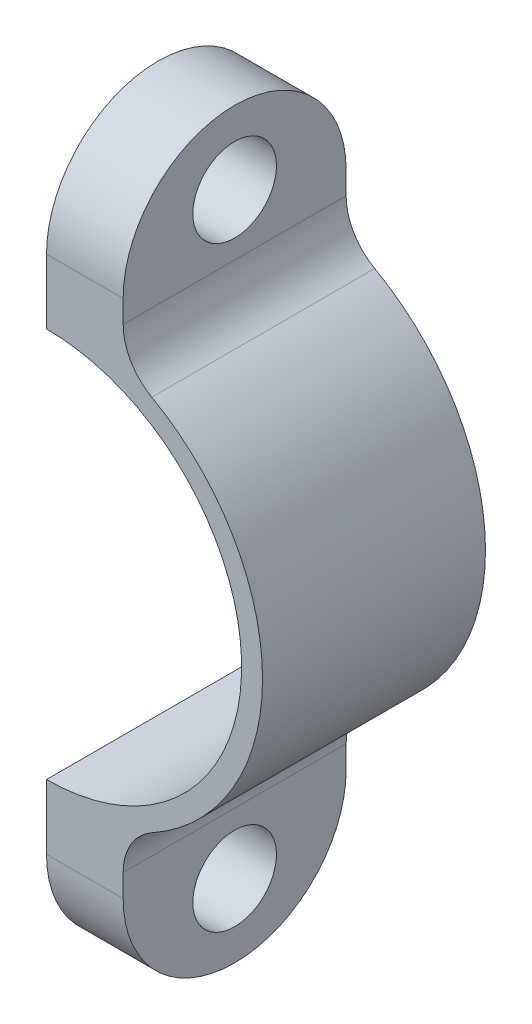
ISO-10303-21;
HEADER;
FILE_DESCRIPTION(('STEP AP214'),'2;1');
FILE_NAME('part.step','',(''),(''),'','','');
FILE_SCHEMA(('AUTOMOTIVE_DESIGN { 1 0 10303 214 1 1 1 1 }'));
ENDSEC;
DATA;
#1=APPLICATION_CONTEXT('core data for automotive mechanical design processes');
#2=APPLICATION_PROTOCOL_DEFINITION('international standard','automotive_design',2000,#1);
#3=PRODUCT_CONTEXT('',#1,'mechanical');
#4=PRODUCT('Part','Part','',(#3));
#5=PRODUCT_RELATED_PRODUCT_CATEGORY('part','',(#4));
#6=PRODUCT_DEFINITION_FORMATION('','',#4);
#7=PRODUCT_DEFINITION_CONTEXT('part definition',#1,'design');
#8=PRODUCT_DEFINITION('design','',#6,#7);
#9=PRODUCT_DEFINITION_SHAPE('','',#8);
#10=(LENGTH_UNIT() NAMED_UNIT(*) SI_UNIT(.MILLI.,.METRE.));
#11=(NAMED_UNIT(*) PLANE_ANGLE_UNIT() SI_UNIT($,.RADIAN.));
#12=(NAMED_UNIT(*) SI_UNIT($,.STERADIAN.) SOLID_ANGLE_UNIT());
#13=UNCERTAINTY_MEASURE_WITH_UNIT(LENGTH_MEASURE(1.E-05),#10,'distance_accuracy_value','');
#14=(GEOMETRIC_REPRESENTATION_CONTEXT(3) GLOBAL_UNCERTAINTY_ASSIGNED_CONTEXT((#13)) GLOBAL_UNIT_ASSIGNED_CONTEXT((#10,
#11,#12)) REPRESENTATION_CONTEXT('',''));
#15=CARTESIAN_POINT('',(0.,0.,0.));
#16=DIRECTION('',(0.,0.,1.));
#17=DIRECTION('',(1.,0.,0.));
#18=AXIS2_PLACEMENT_3D('',#15,#16,#17);
#19=CARTESIAN_POINT('',(0.,0.,0.));
#20=DIRECTION('',(0.,0.,1.));
#21=DIRECTION('',(1.,0.,0.));
#22=AXIS2_PLACEMENT_3D('',#19,#20,#21);
#23=PLANE('',#22);
#24=DIRECTION('',(0.,-1.,0.));
#25=VECTOR('',#24,1.);
#26=CARTESIAN_POINT('',(0.,-14.,0.));
#27=LINE('',#26,#25);
#28=CARTESIAN_POINT('',(0.,-15.5,0.));
#29=VERTEX_POINT('',#28);
#30=CARTESIAN_POINT('',(0.,-18.650000914836,0.));
#31=VERTEX_POINT('',#30);
#32=EDGE_CURVE('E187',#29,#31,#27,.T.);
#33=ORIENTED_EDGE('',*,*,#32,.F.);
#34=CARTESIAN_POINT('',(0.,0.,0.));
#35=DIRECTION('',(0.,0.,1.));
#36=DIRECTION('',(1.,0.,0.));
#37=AXIS2_PLACEMENT_3D('',#34,#35,#36);
#38=CIRCLE('',#37,15.5);
#39=CARTESIAN_POINT('',(7.55128205128205,-13.5361789062492,0.));
#40=VERTEX_POINT('',#39);
#41=EDGE_CURVE('E72',#29,#40,#38,.T.);
#42=ORIENTED_EDGE('',*,*,#41,.T.);
#43=CARTESIAN_POINT('',(9.5,-17.0293863659264,0.));
#44=DIRECTION('',(0.,0.,1.));
#45=DIRECTION('',(1.,0.,0.));
#46=AXIS2_PLACEMENT_3D('',#43,#44,#45);
#47=CIRCLE('',#46,4.);
#48=CARTESIAN_POINT('',(5.5,-17.0293863659264,0.));
#49=VERTEX_POINT('',#48);
#50=EDGE_CURVE('E227',#40,#49,#47,.T.);
#51=ORIENTED_EDGE('',*,*,#50,.T.);
#52=DIRECTION('',(0.,1.,0.));
#53=VECTOR('',#52,1.);
#54=CARTESIAN_POINT('',(5.5,0.,0.));
#55=LINE('',#54,#53);
#56=CARTESIAN_POINT('',(5.5,-18.650000914836,0.));
#57=VERTEX_POINT('',#56);
#58=EDGE_CURVE('E173',#57,#49,#55,.T.);
#59=ORIENTED_EDGE('',*,*,#58,.F.);
#60=DIRECTION('',(-1.,0.,0.));
#61=VECTOR('',#60,1.);
#62=CARTESIAN_POINT('',(5.5,-18.650000914836,0.));
#63=LINE('',#62,#61);
#64=EDGE_CURVE('E184',#57,#31,#63,.T.);
#65=ORIENTED_EDGE('',*,*,#64,.T.);
#66=EDGE_LOOP('',(#33,#42,#51,#59,#65));
#67=FACE_BOUND('',#66,.T.);
#68=ADVANCED_FACE('F38',(#67),#23,.F.);
#69=CARTESIAN_POINT('',(0.,0.,16.));
#70=DIRECTION('',(0.,0.,-1.));
#71=DIRECTION('',(-1.,0.,0.));
#72=AXIS2_PLACEMENT_3D('',#69,#70,#71);
#73=CYLINDRICAL_SURFACE('',#72,15.5);
#74=CARTESIAN_POINT('',(0.,0.,16.));
#75=DIRECTION('',(0.,0.,1.));
#76=DIRECTION('',(1.,0.,0.));
#77=AXIS2_PLACEMENT_3D('',#74,#75,#76);
#78=CIRCLE('',#77,15.5);
#79=CARTESIAN_POINT('',(7.55128205128205,-13.5361789062492,16.));
#80=VERTEX_POINT('',#79);
#81=CARTESIAN_POINT('',(7.55128205128205,13.5361789062492,16.));
#82=VERTEX_POINT('',#81);
#83=EDGE_CURVE('E195',#80,#82,#78,.T.);
#84=ORIENTED_EDGE('',*,*,#83,.F.);
#85=DIRECTION('',(0.,0.,-1.));
#86=VECTOR('',#85,1.);
#87=CARTESIAN_POINT('',(7.55128205128205,-13.5361789062492,16.));
#88=LINE('',#87,#86);
#89=EDGE_CURVE('E222',#80,#40,#88,.T.);
#90=ORIENTED_EDGE('',*,*,#89,.T.);
#91=CARTESIAN_POINT('',(0.,0.,0.));
#92=DIRECTION('',(0.,0.,1.));
#93=DIRECTION('',(1.,0.,0.));
#94=AXIS2_PLACEMENT_3D('',#91,#92,#93);
#95=CIRCLE('',#94,15.5);
#96=CARTESIAN_POINT('',(7.55128205128205,13.5361789062492,0.));
#97=VERTEX_POINT('',#96);
#98=EDGE_CURVE('E201',#40,#97,#95,.T.);
#99=ORIENTED_EDGE('',*,*,#98,.T.);
#100=DIRECTION('',(0.,0.,-1.));
#101=VECTOR('',#100,1.);
#102=CARTESIAN_POINT('',(7.55128205128205,13.5361789062492,16.));
#103=LINE('',#102,#101);
#104=EDGE_CURVE('E78',#97,#82,#103,.F.);
#105=ORIENTED_EDGE('',*,*,#104,.T.);
#106=EDGE_LOOP('',(#84,#90,#99,#105));
#107=FACE_BOUND('',#106,.T.);
#108=ADVANCED_FACE('F233',(#107),#73,.T.);
#109=CARTESIAN_POINT('',(0.,0.,16.));
#110=DIRECTION('',(0.,0.,-1.));
#111=DIRECTION('',(-1.,0.,0.));
#112=AXIS2_PLACEMENT_3D('',#109,#110,#111);
#113=CYLINDRICAL_SURFACE('',#112,14.);
#114=DIRECTION('',(0.,0.,-1.));
#115=VECTOR('',#114,1.);
#116=CARTESIAN_POINT('',(0.,14.,16.));
#117=LINE('',#116,#115);
#118=CARTESIAN_POINT('',(0.,14.,16.));
#119=VERTEX_POINT('',#118);
#120=CARTESIAN_POINT('',(0.,14.,1.5));
#121=VERTEX_POINT('',#120);
#122=EDGE_CURVE('E199',#119,#121,#117,.T.);
#123=ORIENTED_EDGE('',*,*,#122,.T.);
#124=CARTESIAN_POINT('',(0.,0.,1.5));
#125=DIRECTION('',(0.,0.,1.));
#126=DIRECTION('',(1.,0.,0.));
#127=AXIS2_PLACEMENT_3D('',#124,#125,#126);
#128=CIRCLE('',#127,14.);
#129=CARTESIAN_POINT('',(0.,-14.,1.5));
#130=VERTEX_POINT('',#129);
#131=EDGE_CURVE('E209',#121,#130,#128,.F.);
#132=ORIENTED_EDGE('',*,*,#131,.T.);
#133=DIRECTION('',(0.,0.,-1.));
#134=VECTOR('',#133,1.);
#135=CARTESIAN_POINT('',(0.,-14.,16.));
#136=LINE('',#135,#134);
#137=CARTESIAN_POINT('',(0.,-14.,16.));
#138=VERTEX_POINT('',#137);
#139=EDGE_CURVE('E206',#138,#130,#136,.T.);
#140=ORIENTED_EDGE('',*,*,#139,.F.);
#141=CARTESIAN_POINT('',(0.,0.,16.));
#142=DIRECTION('',(0.,0.,-1.));
#143=DIRECTION('',(1.,0.,0.));
#144=AXIS2_PLACEMENT_3D('',#141,#142,#143);
#145=CIRCLE('',#144,14.);
#146=EDGE_CURVE('E190',#119,#138,#145,.T.);
#147=ORIENTED_EDGE('',*,*,#146,.F.);
#148=EDGE_LOOP('',(#123,#132,#140,#147));
#149=FACE_BOUND('',#148,.T.);
#150=ADVANCED_FACE('F251',(#149),#113,.F.);
#151=CARTESIAN_POINT('',(0.,-14.,16.));
#152=DIRECTION('',(1.,0.,0.));
#153=DIRECTION('',(0.,1.,0.));
#154=AXIS2_PLACEMENT_3D('',#151,#152,#153);
#155=PLANE('',#154);
#156=ORIENTED_EDGE('',*,*,#139,.T.);
#157=CARTESIAN_POINT('',(0.,-15.5,1.5));
#158=DIRECTION('',(1.,0.,0.));
#159=DIRECTION('',(0.,1.,0.));
#160=AXIS2_PLACEMENT_3D('',#157,#158,#159);
#161=CIRCLE('',#160,1.5);
#162=EDGE_CURVE('E212',#130,#29,#161,.F.);
#163=ORIENTED_EDGE('',*,*,#162,.T.);
#164=ORIENTED_EDGE('',*,*,#32,.T.);
#165=CARTESIAN_POINT('',(0.,-18.65,8.));
#166=DIRECTION('',(-1.,0.,0.));
#167=DIRECTION('',(0.,0.,1.));
#168=AXIS2_PLACEMENT_3D('',#165,#166,#167);
#169=CIRCLE('',#168,8.00000000000004);
#170=CARTESIAN_POINT('',(0.,-18.650000914836,16.));
#171=VERTEX_POINT('',#170);
#172=EDGE_CURVE('E165',#171,#31,#169,.F.);
#173=ORIENTED_EDGE('',*,*,#172,.F.);
#174=DIRECTION('',(0.,-1.,0.));
#175=VECTOR('',#174,1.);
#176=CARTESIAN_POINT('',(0.,-14.,16.));
#177=LINE('',#176,#175);
#178=EDGE_CURVE('E193',#138,#171,#177,.T.);
#179=ORIENTED_EDGE('',*,*,#178,.F.);
#180=EDGE_LOOP('',(#156,#163,#164,#173,#179));
#181=FACE_BOUND('',#180,.T.);
#182=CARTESIAN_POINT('',(0.,-21.4,8.));
#183=DIRECTION('',(-1.,0.,0.));
#184=DIRECTION('',(0.,0.,1.));
#185=AXIS2_PLACEMENT_3D('',#182,#183,#184);
#186=CIRCLE('',#185,3.);
#187=CARTESIAN_POINT('',(0.,-21.4,11.));
#188=VERTEX_POINT('',#187);
#189=EDGE_CURVE('E171',#188,#188,#186,.F.);
#190=ORIENTED_EDGE('',*,*,#189,.T.);
#191=EDGE_LOOP('',(#190));
#192=FACE_BOUND('',#191,.T.);
#193=ADVANCED_FACE('F254',(#181,#192),#155,.F.);
#194=CARTESIAN_POINT('',(0.,15.5,16.));
#195=DIRECTION('',(1.,0.,0.));
#196=DIRECTION('',(0.,1.,0.));
#197=AXIS2_PLACEMENT_3D('',#194,#195,#196);
#198=PLANE('',#197);
#199=DIRECTION('',(0.,-1.,0.));
#200=VECTOR('',#199,1.);
#201=CARTESIAN_POINT('',(0.,15.5,0.));
#202=LINE('',#201,#200);
#203=CARTESIAN_POINT('',(0.,18.650000914836,0.));
#204=VERTEX_POINT('',#203);
#205=CARTESIAN_POINT('',(0.,15.5,0.));
#206=VERTEX_POINT('',#205);
#207=EDGE_CURVE('E136',#204,#206,#202,.T.);
#208=ORIENTED_EDGE('',*,*,#207,.T.);
#209=CARTESIAN_POINT('',(0.,15.5,1.5));
#210=DIRECTION('',(1.,0.,0.));
#211=DIRECTION('',(0.,1.,0.));
#212=AXIS2_PLACEMENT_3D('',#209,#210,#211);
#213=CIRCLE('',#212,1.5);
#214=EDGE_CURVE('E216',#206,#121,#213,.F.);
#215=ORIENTED_EDGE('',*,*,#214,.T.);
#216=ORIENTED_EDGE('',*,*,#122,.F.);
#217=DIRECTION('',(0.,-1.,0.));
#218=VECTOR('',#217,1.);
#219=CARTESIAN_POINT('',(0.,15.5,16.));
#220=LINE('',#219,#218);
#221=CARTESIAN_POINT('',(0.,18.650000914836,16.));
#222=VERTEX_POINT('',#221);
#223=EDGE_CURVE('E197',#222,#119,#220,.T.);
#224=ORIENTED_EDGE('',*,*,#223,.F.);
#225=CARTESIAN_POINT('',(0.,18.65,8.));
#226=DIRECTION('',(-1.,0.,0.));
#227=DIRECTION('',(0.,0.,1.));
#228=AXIS2_PLACEMENT_3D('',#225,#226,#227);
#229=CIRCLE('',#228,8.00000000000004);
#230=EDGE_CURVE('E158',#222,#204,#229,.T.);
#231=ORIENTED_EDGE('',*,*,#230,.T.);
#232=EDGE_LOOP('',(#208,#215,#216,#224,#231));
#233=FACE_BOUND('',#232,.T.);
#234=CARTESIAN_POINT('',(0.,21.4,8.));
#235=DIRECTION('',(-1.,0.,0.));
#236=DIRECTION('',(0.,0.,1.));
#237=AXIS2_PLACEMENT_3D('',#234,#235,#236);
#238=CIRCLE('',#237,3.);
#239=CARTESIAN_POINT('',(0.,21.4,11.));
#240=VERTEX_POINT('',#239);
#241=EDGE_CURVE('E155',#240,#240,#238,.T.);
#242=ORIENTED_EDGE('',*,*,#241,.F.);
#243=EDGE_LOOP('',(#242));
#244=FACE_BOUND('',#243,.T.);
#245=ADVANCED_FACE('F257',(#233,#244),#198,.F.);
#246=CARTESIAN_POINT('',(0.,0.,16.));
#247=DIRECTION('',(0.,0.,1.));
#248=DIRECTION('',(1.,0.,0.));
#249=AXIS2_PLACEMENT_3D('',#246,#247,#248);
#250=PLANE('',#249);
#251=ORIENTED_EDGE('',*,*,#223,.T.);
#252=ORIENTED_EDGE('',*,*,#146,.T.);
#253=ORIENTED_EDGE('',*,*,#178,.T.);
#254=DIRECTION('',(-1.,0.,0.));
#255=VECTOR('',#254,1.);
#256=CARTESIAN_POINT('',(5.5,-18.650000914836,16.));
#257=LINE('',#256,#255);
#258=CARTESIAN_POINT('',(5.5,-18.650000914836,16.));
#259=VERTEX_POINT('',#258);
#260=EDGE_CURVE('E179',#259,#171,#257,.T.);
#261=ORIENTED_EDGE('',*,*,#260,.F.);
#262=DIRECTION('',(0.,-1.,0.));
#263=VECTOR('',#262,1.);
#264=CARTESIAN_POINT('',(5.5,0.,16.0000000000001));
#265=LINE('',#264,#263);
#266=CARTESIAN_POINT('',(5.5,-17.0293863659264,16.));
#267=VERTEX_POINT('',#266);
#268=EDGE_CURVE('E170',#267,#259,#265,.T.);
#269=ORIENTED_EDGE('',*,*,#268,.F.);
#270=CARTESIAN_POINT('',(9.5,-17.0293863659264,16.));
#271=DIRECTION('',(0.,0.,1.));
#272=DIRECTION('',(1.,0.,0.));
#273=AXIS2_PLACEMENT_3D('',#270,#271,#272);
#274=CIRCLE('',#273,4.);
#275=EDGE_CURVE('E225',#267,#80,#274,.F.);
#276=ORIENTED_EDGE('',*,*,#275,.T.);
#277=ORIENTED_EDGE('',*,*,#83,.T.);
#278=CARTESIAN_POINT('',(9.5,17.0293863659264,16.));
#279=DIRECTION('',(0.,0.,1.));
#280=DIRECTION('',(1.,0.,0.));
#281=AXIS2_PLACEMENT_3D('',#278,#279,#280);
#282=CIRCLE('',#281,4.);
#283=CARTESIAN_POINT('',(5.5,17.0293863659264,16.));
#284=VERTEX_POINT('',#283);
#285=EDGE_CURVE('E11',#82,#284,#282,.F.);
#286=ORIENTED_EDGE('',*,*,#285,.T.);
#287=DIRECTION('',(0.,1.,0.));
#288=VECTOR('',#287,1.);
#289=CARTESIAN_POINT('',(5.5,0.,16.0000000000001));
#290=LINE('',#289,#288);
#291=CARTESIAN_POINT('',(5.5,18.650000914836,16.));
#292=VERTEX_POINT('',#291);
#293=EDGE_CURVE('E150',#284,#292,#290,.T.);
#294=ORIENTED_EDGE('',*,*,#293,.T.);
#295=DIRECTION('',(-1.,0.,0.));
#296=VECTOR('',#295,1.);
#297=CARTESIAN_POINT('',(5.5,18.650000914836,16.));
#298=LINE('',#297,#296);
#299=EDGE_CURVE('E141',#292,#222,#298,.T.);
#300=ORIENTED_EDGE('',*,*,#299,.T.);
#301=EDGE_LOOP('',(#251,#252,#253,#261,#269,#276,#277,#286,#294,#300));
#302=FACE_BOUND('',#301,.T.);
#303=ADVANCED_FACE('F230',(#302),#250,.T.);
#304=DIRECTION('',(0.,-1.,0.));
#305=VECTOR('',#304,1.);
#306=CARTESIAN_POINT('',(5.5,0.,0.));
#307=LINE('',#306,#305);
#308=CARTESIAN_POINT('',(5.5,18.650000914836,0.));
#309=VERTEX_POINT('',#308);
#310=CARTESIAN_POINT('',(5.5,17.0293863659264,0.));
#311=VERTEX_POINT('',#310);
#312=EDGE_CURVE('E134',#309,#311,#307,.T.);
#313=ORIENTED_EDGE('',*,*,#312,.T.);
#314=CARTESIAN_POINT('',(9.5,17.0293863659264,0.));
#315=DIRECTION('',(0.,0.,1.));
#316=DIRECTION('',(1.,0.,0.));
#317=AXIS2_PLACEMENT_3D('',#314,#315,#316);
#318=CIRCLE('',#317,4.);
#319=EDGE_CURVE('E46',#311,#97,#318,.T.);
#320=ORIENTED_EDGE('',*,*,#319,.T.);
#321=CARTESIAN_POINT('',(0.,0.,0.));
#322=DIRECTION('',(0.,0.,1.));
#323=DIRECTION('',(1.,0.,0.));
#324=AXIS2_PLACEMENT_3D('',#321,#322,#323);
#325=CIRCLE('',#324,15.5);
#326=EDGE_CURVE('E53',#97,#206,#325,.T.);
#327=ORIENTED_EDGE('',*,*,#326,.T.);
#328=ORIENTED_EDGE('',*,*,#207,.F.);
#329=DIRECTION('',(-1.,0.,0.));
#330=VECTOR('',#329,1.);
#331=CARTESIAN_POINT('',(5.5,18.650000914836,0.));
#332=LINE('',#331,#330);
#333=EDGE_CURVE('E131',#309,#204,#332,.T.);
#334=ORIENTED_EDGE('',*,*,#333,.F.);
#335=EDGE_LOOP('',(#313,#320,#327,#328,#334));
#336=FACE_BOUND('',#335,.T.);
#337=ADVANCED_FACE('F133',(#336),#23,.F.);
#338=CARTESIAN_POINT('',(5.5,0.,0.));
#339=DIRECTION('',(-1.,0.,0.));
#340=DIRECTION('',(0.,0.,1.));
#341=AXIS2_PLACEMENT_3D('',#338,#339,#340);
#342=PLANE('',#341);
#343=CARTESIAN_POINT('',(5.5,-21.4,8.));
#344=DIRECTION('',(-1.,0.,0.));
#345=DIRECTION('',(0.,0.,1.));
#346=AXIS2_PLACEMENT_3D('',#343,#344,#345);
#347=CIRCLE('',#346,3.);
#348=CARTESIAN_POINT('',(5.5,-21.4,11.));
#349=VERTEX_POINT('',#348);
#350=EDGE_CURVE('E176',#349,#349,#347,.F.);
#351=ORIENTED_EDGE('',*,*,#350,.F.);
#352=EDGE_LOOP('',(#351));
#353=FACE_BOUND('',#352,.T.);
#354=ORIENTED_EDGE('',*,*,#58,.T.);
#355=DIRECTION('',(0.,0.,1.));
#356=VECTOR('',#355,1.);
#357=CARTESIAN_POINT('',(5.5,-17.0293863659264,16.));
#358=LINE('',#357,#356);
#359=EDGE_CURVE('E218',#49,#267,#358,.T.);
#360=ORIENTED_EDGE('',*,*,#359,.T.);
#361=ORIENTED_EDGE('',*,*,#268,.T.);
#362=CARTESIAN_POINT('',(5.5,-18.65,8.));
#363=DIRECTION('',(-1.,0.,0.));
#364=DIRECTION('',(0.,0.,1.));
#365=AXIS2_PLACEMENT_3D('',#362,#363,#364);
#366=CIRCLE('',#365,8.00000000000004);
#367=EDGE_CURVE('E167',#259,#57,#366,.F.);
#368=ORIENTED_EDGE('',*,*,#367,.T.);
#369=EDGE_LOOP('',(#354,#360,#361,#368));
#370=FACE_BOUND('',#369,.T.);
#371=ADVANCED_FACE('F239',(#353,#370),#342,.F.);
#372=CARTESIAN_POINT('',(5.5,-18.65,8.));
#373=DIRECTION('',(-1.,0.,0.));
#374=DIRECTION('',(0.,0.,1.));
#375=AXIS2_PLACEMENT_3D('',#372,#373,#374);
#376=CYLINDRICAL_SURFACE('',#375,8.00000000000004);
#377=ORIENTED_EDGE('',*,*,#172,.T.);
#378=ORIENTED_EDGE('',*,*,#64,.F.);
#379=ORIENTED_EDGE('',*,*,#367,.F.);
#380=ORIENTED_EDGE('',*,*,#260,.T.);
#381=EDGE_LOOP('',(#377,#378,#379,#380));
#382=FACE_BOUND('',#381,.T.);
#383=ADVANCED_FACE('F244',(#382),#376,.T.);
#384=CARTESIAN_POINT('',(5.5,-21.4,8.));
#385=DIRECTION('',(-1.,0.,0.));
#386=DIRECTION('',(0.,0.,1.));
#387=AXIS2_PLACEMENT_3D('',#384,#385,#386);
#388=CYLINDRICAL_SURFACE('',#387,3.);
#389=ORIENTED_EDGE('',*,*,#350,.T.);
#390=EDGE_LOOP('',(#389));
#391=FACE_BOUND('',#390,.T.);
#392=ORIENTED_EDGE('',*,*,#189,.F.);
#393=EDGE_LOOP('',(#392));
#394=FACE_BOUND('',#393,.T.);
#395=ADVANCED_FACE('F294',(#391,#394),#388,.F.);
#396=CARTESIAN_POINT('',(5.5,0.,0.));
#397=DIRECTION('',(-1.,0.,0.));
#398=DIRECTION('',(0.,0.,1.));
#399=AXIS2_PLACEMENT_3D('',#396,#397,#398);
#400=PLANE('',#399);
#401=CARTESIAN_POINT('',(5.5,21.4,8.));
#402=DIRECTION('',(-1.,0.,0.));
#403=DIRECTION('',(0.,0.,1.));
#404=AXIS2_PLACEMENT_3D('',#401,#402,#403);
#405=CIRCLE('',#404,3.);
#406=CARTESIAN_POINT('',(5.5,21.4,11.));
#407=VERTEX_POINT('',#406);
#408=EDGE_CURVE('E142',#407,#407,#405,.T.);
#409=ORIENTED_EDGE('',*,*,#408,.T.);
#410=EDGE_LOOP('',(#409));
#411=FACE_BOUND('',#410,.T.);
#412=ORIENTED_EDGE('',*,*,#293,.F.);
#413=DIRECTION('',(0.,0.,1.));
#414=VECTOR('',#413,1.);
#415=CARTESIAN_POINT('',(5.5,17.0293863659264,0.));
#416=LINE('',#415,#414);
#417=EDGE_CURVE('E149',#284,#311,#416,.F.);
#418=ORIENTED_EDGE('',*,*,#417,.T.);
#419=ORIENTED_EDGE('',*,*,#312,.F.);
#420=CARTESIAN_POINT('',(5.5,18.65,8.));
#421=DIRECTION('',(-1.,0.,0.));
#422=DIRECTION('',(0.,0.,1.));
#423=AXIS2_PLACEMENT_3D('',#420,#421,#422);
#424=CIRCLE('',#423,8.00000000000004);
#425=EDGE_CURVE('E148',#292,#309,#424,.T.);
#426=ORIENTED_EDGE('',*,*,#425,.F.);
#427=EDGE_LOOP('',(#412,#418,#419,#426));
#428=FACE_BOUND('',#427,.T.);
#429=ADVANCED_FACE('F147',(#411,#428),#400,.F.);
#430=CARTESIAN_POINT('',(5.5,18.65,8.));
#431=DIRECTION('',(-1.,0.,0.));
#432=DIRECTION('',(0.,0.,1.));
#433=AXIS2_PLACEMENT_3D('',#430,#431,#432);
#434=CYLINDRICAL_SURFACE('',#433,8.00000000000004);
#435=ORIENTED_EDGE('',*,*,#230,.F.);
#436=ORIENTED_EDGE('',*,*,#299,.F.);
#437=ORIENTED_EDGE('',*,*,#425,.T.);
#438=ORIENTED_EDGE('',*,*,#333,.T.);
#439=EDGE_LOOP('',(#435,#436,#437,#438));
#440=FACE_BOUND('',#439,.T.);
#441=ADVANCED_FACE('F153',(#440),#434,.T.);
#442=CARTESIAN_POINT('',(5.5,21.4,8.));
#443=DIRECTION('',(-1.,0.,0.));
#444=DIRECTION('',(0.,0.,1.));
#445=AXIS2_PLACEMENT_3D('',#442,#443,#444);
#446=CYLINDRICAL_SURFACE('',#445,3.);
#447=ORIENTED_EDGE('',*,*,#408,.F.);
#448=EDGE_LOOP('',(#447));
#449=FACE_BOUND('',#448,.T.);
#450=ORIENTED_EDGE('',*,*,#241,.T.);
#451=EDGE_LOOP('',(#450));
#452=FACE_BOUND('',#451,.T.);
#453=ADVANCED_FACE('F263',(#449,#452),#446,.F.);
#454=CARTESIAN_POINT('',(0.,0.,1.5));
#455=DIRECTION('',(0.,0.,1.));
#456=DIRECTION('',(1.,0.,0.));
#457=AXIS2_PLACEMENT_3D('',#454,#455,#456);
#458=TOROIDAL_SURFACE('',#457,15.5,1.5);
#459=ORIENTED_EDGE('',*,*,#98,.F.);
#460=ORIENTED_EDGE('',*,*,#41,.F.);
#461=ORIENTED_EDGE('',*,*,#162,.F.);
#462=ORIENTED_EDGE('',*,*,#131,.F.);
#463=ORIENTED_EDGE('',*,*,#214,.F.);
#464=ORIENTED_EDGE('',*,*,#326,.F.);
#465=EDGE_LOOP('',(#459,#460,#461,#462,#463,#464));
#466=FACE_BOUND('',#465,.T.);
#467=ADVANCED_FACE('F247',(#466),#458,.T.);
#468=CARTESIAN_POINT('',(9.5,-17.0293863659264,16.));
#469=DIRECTION('',(0.,0.,-1.));
#470=DIRECTION('',(-1.,0.,0.));
#471=AXIS2_PLACEMENT_3D('',#468,#469,#470);
#472=CYLINDRICAL_SURFACE('',#471,4.);
#473=ORIENTED_EDGE('',*,*,#50,.F.);
#474=ORIENTED_EDGE('',*,*,#89,.F.);
#475=ORIENTED_EDGE('',*,*,#275,.F.);
#476=ORIENTED_EDGE('',*,*,#359,.F.);
#477=EDGE_LOOP('',(#473,#474,#475,#476));
#478=FACE_BOUND('',#477,.T.);
#479=ADVANCED_FACE('F236',(#478),#472,.F.);
#480=CARTESIAN_POINT('',(9.5,17.0293863659264,16.));
#481=DIRECTION('',(0.,0.,-1.));
#482=DIRECTION('',(-1.,0.,0.));
#483=AXIS2_PLACEMENT_3D('',#480,#481,#482);
#484=CYLINDRICAL_SURFACE('',#483,4.);
#485=ORIENTED_EDGE('',*,*,#285,.F.);
#486=ORIENTED_EDGE('',*,*,#104,.F.);
#487=ORIENTED_EDGE('',*,*,#319,.F.);
#488=ORIENTED_EDGE('',*,*,#417,.F.);
#489=EDGE_LOOP('',(#485,#486,#487,#488));
#490=FACE_BOUND('',#489,.T.);
#491=ADVANCED_FACE('F40',(#490),#484,.F.);
#492=CLOSED_SHELL('',(#68,#108,#150,#193,#245,#303,#337,#371,#383,#395,#429,#441,#453,#467,#479,#491));
#493=MANIFOLD_SOLID_BREP('B2',#492);
#494=ADVANCED_BREP_SHAPE_REPRESENTATION('',(#18,#493),#14);
#495=SHAPE_DEFINITION_REPRESENTATION(#9,#494);
ENDSEC;
END-ISO-10303-21;
